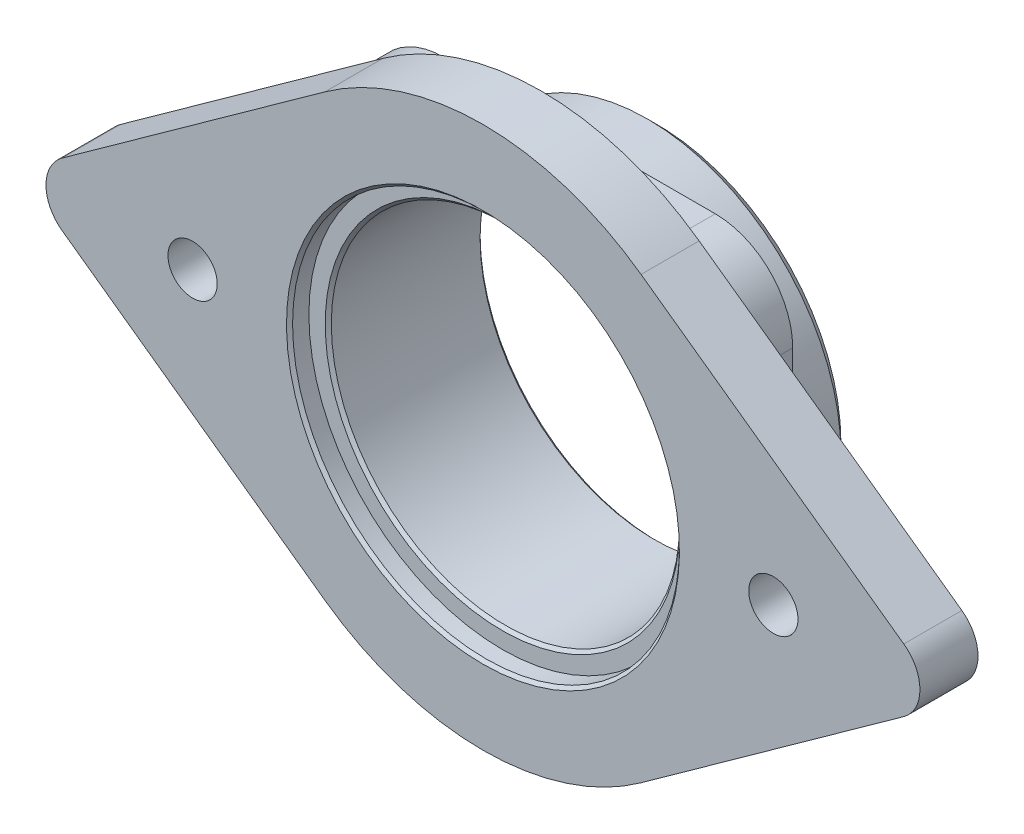
ISO-10303-21;
HEADER;
FILE_DESCRIPTION(('STEP AP214'),'2;1');
FILE_NAME('part.step','',(''),(''),'','','');
FILE_SCHEMA(('AUTOMOTIVE_DESIGN { 1 0 10303 214 1 1 1 1 }'));
ENDSEC;
DATA;
#1=APPLICATION_CONTEXT('core data for automotive mechanical design processes');
#2=APPLICATION_PROTOCOL_DEFINITION('international standard','automotive_design',2000,#1);
#3=PRODUCT_CONTEXT('',#1,'mechanical');
#4=PRODUCT('Part','Part','',(#3));
#5=PRODUCT_RELATED_PRODUCT_CATEGORY('part','',(#4));
#6=PRODUCT_DEFINITION_FORMATION('','',#4);
#7=PRODUCT_DEFINITION_CONTEXT('part definition',#1,'design');
#8=PRODUCT_DEFINITION('design','',#6,#7);
#9=PRODUCT_DEFINITION_SHAPE('','',#8);
#10=(LENGTH_UNIT() NAMED_UNIT(*) SI_UNIT(.MILLI.,.METRE.));
#11=(NAMED_UNIT(*) PLANE_ANGLE_UNIT() SI_UNIT($,.RADIAN.));
#12=(NAMED_UNIT(*) SI_UNIT($,.STERADIAN.) SOLID_ANGLE_UNIT());
#13=UNCERTAINTY_MEASURE_WITH_UNIT(LENGTH_MEASURE(1.E-05),#10,'distance_accuracy_value','');
#14=(GEOMETRIC_REPRESENTATION_CONTEXT(3) GLOBAL_UNCERTAINTY_ASSIGNED_CONTEXT((#13)) GLOBAL_UNIT_ASSIGNED_CONTEXT((#10,
#11,#12)) REPRESENTATION_CONTEXT('',''));
#15=CARTESIAN_POINT('',(0.,0.,0.));
#16=DIRECTION('',(0.,0.,1.));
#17=DIRECTION('',(1.,0.,0.));
#18=AXIS2_PLACEMENT_3D('',#15,#16,#17);
#19=CARTESIAN_POINT('',(0.,0.,-11.90625));
#20=DIRECTION('',(0.,0.,-1.));
#21=DIRECTION('',(-1.,0.,0.));
#22=AXIS2_PLACEMENT_3D('',#19,#20,#21);
#23=PLANE('',#22);
#24=CARTESIAN_POINT('',(0.,0.,-11.90625));
#25=DIRECTION('',(0.,0.,-1.));
#26=DIRECTION('',(-1.,0.,0.));
#27=AXIS2_PLACEMENT_3D('',#24,#25,#26);
#28=CIRCLE('',#27,14.5248);
#29=CARTESIAN_POINT('',(-14.5248,0.,-11.90625));
#30=VERTEX_POINT('',#29);
#31=EDGE_CURVE('E19',#30,#30,#28,.F.);
#32=ORIENTED_EDGE('',*,*,#31,.T.);
#33=EDGE_LOOP('',(#32));
#34=FACE_BOUND('',#33,.T.);
#35=CARTESIAN_POINT('',(0.,0.,-11.90625));
#36=DIRECTION('',(0.,0.,1.));
#37=DIRECTION('',(1.,0.,0.));
#38=AXIS2_PLACEMENT_3D('',#35,#36,#37);
#39=CIRCLE('',#38,15.06855);
#40=CARTESIAN_POINT('',(15.06855,0.,-11.90625));
#41=VERTEX_POINT('',#40);
#42=EDGE_CURVE('E167',#41,#41,#39,.T.);
#43=ORIENTED_EDGE('',*,*,#42,.F.);
#44=EDGE_LOOP('',(#43));
#45=FACE_BOUND('',#44,.T.);
#46=ADVANCED_FACE('F16',(#34,#45),#23,.T.);
#47=CARTESIAN_POINT('',(0.,0.,-11.90625));
#48=DIRECTION('',(0.,0.,-1.));
#49=DIRECTION('',(-1.,0.,0.));
#50=AXIS2_PLACEMENT_3D('',#47,#48,#49);
#51=CONICAL_SURFACE('',#50,14.5248,0.785398163397452);
#52=CARTESIAN_POINT('',(0.,0.,-11.65625));
#53=DIRECTION('',(0.,0.,-1.));
#54=DIRECTION('',(-1.,0.,0.));
#55=AXIS2_PLACEMENT_3D('',#52,#53,#54);
#56=CIRCLE('',#55,14.2748);
#57=CARTESIAN_POINT('',(-14.2748,0.,-11.65625));
#58=VERTEX_POINT('',#57);
#59=EDGE_CURVE('E165',#58,#58,#56,.F.);
#60=ORIENTED_EDGE('',*,*,#59,.T.);
#61=EDGE_LOOP('',(#60));
#62=FACE_BOUND('',#61,.T.);
#63=ORIENTED_EDGE('',*,*,#31,.F.);
#64=EDGE_LOOP('',(#63));
#65=FACE_BOUND('',#64,.T.);
#66=ADVANCED_FACE('F249',(#62,#65),#51,.F.);
#67=CARTESIAN_POINT('',(0.,0.,-11.1125));
#68=DIRECTION('',(0.,0.,1.));
#69=DIRECTION('',(1.,0.,0.));
#70=AXIS2_PLACEMENT_3D('',#67,#68,#69);
#71=CONICAL_SURFACE('',#70,15.8623,0.785398163397446);
#72=ORIENTED_EDGE('',*,*,#42,.T.);
#73=EDGE_LOOP('',(#72));
#74=FACE_BOUND('',#73,.T.);
#75=CARTESIAN_POINT('',(0.,0.,-11.1125));
#76=DIRECTION('',(0.,0.,1.));
#77=DIRECTION('',(1.,0.,0.));
#78=AXIS2_PLACEMENT_3D('',#75,#76,#77);
#79=CIRCLE('',#78,15.8623);
#80=CARTESIAN_POINT('',(15.8623,0.,-11.1125));
#81=VERTEX_POINT('',#80);
#82=EDGE_CURVE('E162',#81,#81,#79,.T.);
#83=ORIENTED_EDGE('',*,*,#82,.F.);
#84=EDGE_LOOP('',(#83));
#85=FACE_BOUND('',#84,.T.);
#86=ADVANCED_FACE('F251',(#74,#85),#71,.T.);
#87=CARTESIAN_POINT('',(0.,0.,2.38125));
#88=DIRECTION('',(0.,0.,-1.));
#89=DIRECTION('',(-1.,0.,0.));
#90=AXIS2_PLACEMENT_3D('',#87,#88,#89);
#91=CYLINDRICAL_SURFACE('',#90,14.2748);
#92=CARTESIAN_POINT('',(0.,0.,0.543749999999951));
#93=DIRECTION('',(0.,0.,1.));
#94=DIRECTION('',(1.,0.,0.));
#95=AXIS2_PLACEMENT_3D('',#92,#93,#94);
#96=CIRCLE('',#95,14.2748);
#97=CARTESIAN_POINT('',(14.2748,0.,0.54374999999995));
#98=VERTEX_POINT('',#97);
#99=EDGE_CURVE('E158',#98,#98,#96,.T.);
#100=ORIENTED_EDGE('',*,*,#99,.T.);
#101=EDGE_LOOP('',(#100));
#102=FACE_BOUND('',#101,.T.);
#103=ORIENTED_EDGE('',*,*,#59,.F.);
#104=EDGE_LOOP('',(#103));
#105=FACE_BOUND('',#104,.T.);
#106=ADVANCED_FACE('F258',(#102,#105),#91,.F.);
#107=CARTESIAN_POINT('',(0.,0.,-11.90625));
#108=DIRECTION('',(0.,0.,1.));
#109=DIRECTION('',(1.,0.,0.));
#110=AXIS2_PLACEMENT_3D('',#107,#108,#109);
#111=CYLINDRICAL_SURFACE('',#110,15.8623);
#112=ORIENTED_EDGE('',*,*,#82,.T.);
#113=EDGE_LOOP('',(#112));
#114=FACE_BOUND('',#113,.T.);
#115=CARTESIAN_POINT('',(0.,0.,-5.55625));
#116=DIRECTION('',(0.,0.,1.));
#117=DIRECTION('',(1.,0.,0.));
#118=AXIS2_PLACEMENT_3D('',#115,#116,#117);
#119=CIRCLE('',#118,15.8623);
#120=CARTESIAN_POINT('',(15.8623,0.,-5.55625));
#121=VERTEX_POINT('',#120);
#122=EDGE_CURVE('E161',#121,#121,#119,.F.);
#123=ORIENTED_EDGE('',*,*,#122,.T.);
#124=EDGE_LOOP('',(#123));
#125=FACE_BOUND('',#124,.T.);
#126=ADVANCED_FACE('F358',(#114,#125),#111,.T.);
#127=CARTESIAN_POINT('',(0.,0.,0.793750000000002));
#128=DIRECTION('',(0.,0.,1.));
#129=DIRECTION('',(1.,0.,0.));
#130=AXIS2_PLACEMENT_3D('',#127,#128,#129);
#131=CONICAL_SURFACE('',#130,14.5248,0.785398163397435);
#132=ORIENTED_EDGE('',*,*,#99,.F.);
#133=EDGE_LOOP('',(#132));
#134=FACE_BOUND('',#133,.T.);
#135=CARTESIAN_POINT('',(0.,0.,0.793750000000001));
#136=DIRECTION('',(0.,0.,1.));
#137=DIRECTION('',(1.,0.,0.));
#138=AXIS2_PLACEMENT_3D('',#135,#136,#137);
#139=CIRCLE('',#138,14.5248);
#140=CARTESIAN_POINT('',(14.5248,0.,0.793750000000001));
#141=VERTEX_POINT('',#140);
#142=EDGE_CURVE('E138',#141,#141,#139,.F.);
#143=ORIENTED_EDGE('',*,*,#142,.F.);
#144=EDGE_LOOP('',(#143));
#145=FACE_BOUND('',#144,.T.);
#146=ADVANCED_FACE('F354',(#134,#145),#131,.F.);
#147=CARTESIAN_POINT('',(0.,0.,-5.55625));
#148=DIRECTION('',(0.,0.,1.));
#149=DIRECTION('',(1.,0.,0.));
#150=AXIS2_PLACEMENT_3D('',#147,#148,#149);
#151=PLANE('',#150);
#152=ORIENTED_EDGE('',*,*,#122,.F.);
#153=EDGE_LOOP('',(#152));
#154=FACE_BOUND('',#153,.T.);
#155=CARTESIAN_POINT('',(11.1125,-11.1125,-5.55625));
#156=DIRECTION('',(0.,0.,1.));
#157=DIRECTION('',(1.,0.,0.));
#158=AXIS2_PLACEMENT_3D('',#155,#156,#157);
#159=CIRCLE('',#158,6.35);
#160=CARTESIAN_POINT('',(11.1125,-17.4625,-5.55625));
#161=VERTEX_POINT('',#160);
#162=CARTESIAN_POINT('',(17.4625,-11.1125,-5.55625));
#163=VERTEX_POINT('',#162);
#164=EDGE_CURVE('E151',#161,#163,#159,.T.);
#165=ORIENTED_EDGE('',*,*,#164,.F.);
#166=DIRECTION('',(1.,0.,0.));
#167=VECTOR('',#166,1.);
#168=CARTESIAN_POINT('',(17.4625,-17.4625,-5.55625));
#169=LINE('',#168,#167);
#170=CARTESIAN_POINT('',(-11.1125,-17.4625,-5.55625));
#171=VERTEX_POINT('',#170);
#172=EDGE_CURVE('E156',#161,#171,#169,.F.);
#173=ORIENTED_EDGE('',*,*,#172,.T.);
#174=CARTESIAN_POINT('',(-11.1125,-11.1125,-5.55625));
#175=DIRECTION('',(0.,0.,1.));
#176=DIRECTION('',(1.,0.,0.));
#177=AXIS2_PLACEMENT_3D('',#174,#175,#176);
#178=CIRCLE('',#177,6.35);
#179=CARTESIAN_POINT('',(-17.4625,-11.1125,-5.55625));
#180=VERTEX_POINT('',#179);
#181=EDGE_CURVE('E234',#180,#171,#178,.T.);
#182=ORIENTED_EDGE('',*,*,#181,.F.);
#183=DIRECTION('',(0.,1.,0.));
#184=VECTOR('',#183,1.);
#185=CARTESIAN_POINT('',(-17.4625,-17.4625,-5.55625));
#186=LINE('',#185,#184);
#187=CARTESIAN_POINT('',(-17.4625,11.1125,-5.55625));
#188=VERTEX_POINT('',#187);
#189=EDGE_CURVE('E233',#180,#188,#186,.T.);
#190=ORIENTED_EDGE('',*,*,#189,.T.);
#191=CARTESIAN_POINT('',(-11.1125,11.1125,-5.55625));
#192=DIRECTION('',(0.,0.,1.));
#193=DIRECTION('',(1.,0.,0.));
#194=AXIS2_PLACEMENT_3D('',#191,#192,#193);
#195=CIRCLE('',#194,6.35);
#196=CARTESIAN_POINT('',(-11.1125,17.4625,-5.55625));
#197=VERTEX_POINT('',#196);
#198=EDGE_CURVE('E229',#197,#188,#195,.T.);
#199=ORIENTED_EDGE('',*,*,#198,.F.);
#200=DIRECTION('',(1.,0.,0.));
#201=VECTOR('',#200,1.);
#202=CARTESIAN_POINT('',(17.4625,17.4625,-5.55625));
#203=LINE('',#202,#201);
#204=CARTESIAN_POINT('',(11.1125,17.4625,-5.55625));
#205=VERTEX_POINT('',#204);
#206=EDGE_CURVE('E134',#197,#205,#203,.T.);
#207=ORIENTED_EDGE('',*,*,#206,.T.);
#208=CARTESIAN_POINT('',(11.1125,11.1125,-5.55625));
#209=DIRECTION('',(0.,0.,1.));
#210=DIRECTION('',(1.,0.,0.));
#211=AXIS2_PLACEMENT_3D('',#208,#209,#210);
#212=CIRCLE('',#211,6.35);
#213=CARTESIAN_POINT('',(17.4625,11.1125,-5.55625));
#214=VERTEX_POINT('',#213);
#215=EDGE_CURVE('E127',#214,#205,#212,.T.);
#216=ORIENTED_EDGE('',*,*,#215,.F.);
#217=DIRECTION('',(0.,1.,0.));
#218=VECTOR('',#217,1.);
#219=CARTESIAN_POINT('',(17.4625,-17.4625,-5.55625));
#220=LINE('',#219,#218);
#221=EDGE_CURVE('E131',#214,#163,#220,.F.);
#222=ORIENTED_EDGE('',*,*,#221,.T.);
#223=EDGE_LOOP('',(#165,#173,#182,#190,#199,#207,#216,#222));
#224=FACE_BOUND('',#223,.T.);
#225=ADVANCED_FACE('F129',(#154,#224),#151,.F.);
#226=CARTESIAN_POINT('',(0.,0.,0.79375));
#227=DIRECTION('',(0.,0.,1.));
#228=DIRECTION('',(1.,0.,0.));
#229=AXIS2_PLACEMENT_3D('',#226,#227,#228);
#230=PLANE('',#229);
#231=CARTESIAN_POINT('',(0.,0.,0.79375));
#232=DIRECTION('',(0.,0.,1.));
#233=DIRECTION('',(1.,0.,0.));
#234=AXIS2_PLACEMENT_3D('',#231,#232,#233);
#235=CIRCLE('',#234,15.8623);
#236=CARTESIAN_POINT('',(15.8623,0.,0.79375));
#237=VERTEX_POINT('',#236);
#238=EDGE_CURVE('E226',#237,#237,#235,.T.);
#239=ORIENTED_EDGE('',*,*,#238,.T.);
#240=EDGE_LOOP('',(#239));
#241=FACE_BOUND('',#240,.T.);
#242=ORIENTED_EDGE('',*,*,#142,.T.);
#243=EDGE_LOOP('',(#242));
#244=FACE_BOUND('',#243,.T.);
#245=ADVANCED_FACE('F348',(#241,#244),#230,.T.);
#246=CARTESIAN_POINT('',(11.1125,11.1125,-5.55625));
#247=DIRECTION('',(0.,0.,1.));
#248=DIRECTION('',(1.,0.,0.));
#249=AXIS2_PLACEMENT_3D('',#246,#247,#248);
#250=CYLINDRICAL_SURFACE('',#249,6.35);
#251=CARTESIAN_POINT('',(11.1125,11.1125,-2.38125));
#252=DIRECTION('',(0.,0.,1.));
#253=DIRECTION('',(1.,0.,0.));
#254=AXIS2_PLACEMENT_3D('',#251,#252,#253);
#255=CIRCLE('',#254,6.35);
#256=CARTESIAN_POINT('',(11.1125,17.4625,-2.38125));
#257=VERTEX_POINT('',#256);
#258=CARTESIAN_POINT('',(17.4625,11.1125,-2.38125));
#259=VERTEX_POINT('',#258);
#260=EDGE_CURVE('E143',#257,#259,#255,.F.);
#261=ORIENTED_EDGE('',*,*,#260,.T.);
#262=DIRECTION('',(0.,0.,1.));
#263=VECTOR('',#262,1.);
#264=CARTESIAN_POINT('',(17.4625,11.1125,-5.55625));
#265=LINE('',#264,#263);
#266=EDGE_CURVE('E137',#259,#214,#265,.F.);
#267=ORIENTED_EDGE('',*,*,#266,.T.);
#268=ORIENTED_EDGE('',*,*,#215,.T.);
#269=DIRECTION('',(0.,0.,-1.));
#270=VECTOR('',#269,1.);
#271=CARTESIAN_POINT('',(11.1125,17.4625,-5.55625));
#272=LINE('',#271,#270);
#273=EDGE_CURVE('E602',#205,#257,#272,.F.);
#274=ORIENTED_EDGE('',*,*,#273,.T.);
#275=EDGE_LOOP('',(#261,#267,#268,#274));
#276=FACE_BOUND('',#275,.T.);
#277=ADVANCED_FACE('F141',(#276),#250,.T.);
#278=CARTESIAN_POINT('',(17.4625,-17.4625,-5.55625));
#279=DIRECTION('',(-1.,0.,0.));
#280=DIRECTION('',(0.,0.,1.));
#281=AXIS2_PLACEMENT_3D('',#278,#279,#280);
#282=PLANE('',#281);
#283=DIRECTION('',(0.,0.,1.));
#284=VECTOR('',#283,1.);
#285=CARTESIAN_POINT('',(17.4625,-11.1125,-5.55625));
#286=LINE('',#285,#284);
#287=CARTESIAN_POINT('',(17.4625,-11.1125,-2.38125));
#288=VERTEX_POINT('',#287);
#289=EDGE_CURVE('E149',#163,#288,#286,.T.);
#290=ORIENTED_EDGE('',*,*,#289,.F.);
#291=ORIENTED_EDGE('',*,*,#221,.F.);
#292=ORIENTED_EDGE('',*,*,#266,.F.);
#293=DIRECTION('',(0.,1.,0.));
#294=VECTOR('',#293,1.);
#295=CARTESIAN_POINT('',(17.4625,0.,-2.38125));
#296=LINE('',#295,#294);
#297=EDGE_CURVE('E224',#259,#288,#296,.F.);
#298=ORIENTED_EDGE('',*,*,#297,.T.);
#299=EDGE_LOOP('',(#290,#291,#292,#298));
#300=FACE_BOUND('',#299,.T.);
#301=ADVANCED_FACE('F147',(#300),#282,.F.);
#302=CARTESIAN_POINT('',(11.1125,-11.1125,-5.55625));
#303=DIRECTION('',(0.,0.,1.));
#304=DIRECTION('',(1.,0.,0.));
#305=AXIS2_PLACEMENT_3D('',#302,#303,#304);
#306=CYLINDRICAL_SURFACE('',#305,6.35);
#307=CARTESIAN_POINT('',(11.1125,-11.1125,-2.38125));
#308=DIRECTION('',(0.,0.,1.));
#309=DIRECTION('',(1.,0.,0.));
#310=AXIS2_PLACEMENT_3D('',#307,#308,#309);
#311=CIRCLE('',#310,6.35);
#312=CARTESIAN_POINT('',(11.1125,-17.4625,-2.38125));
#313=VERTEX_POINT('',#312);
#314=EDGE_CURVE('E222',#288,#313,#311,.F.);
#315=ORIENTED_EDGE('',*,*,#314,.T.);
#316=DIRECTION('',(0.,0.,1.));
#317=VECTOR('',#316,1.);
#318=CARTESIAN_POINT('',(11.1125,-17.4625,-5.55625));
#319=LINE('',#318,#317);
#320=EDGE_CURVE('E611',#313,#161,#319,.F.);
#321=ORIENTED_EDGE('',*,*,#320,.T.);
#322=ORIENTED_EDGE('',*,*,#164,.T.);
#323=ORIENTED_EDGE('',*,*,#289,.T.);
#324=EDGE_LOOP('',(#315,#321,#322,#323));
#325=FACE_BOUND('',#324,.T.);
#326=ADVANCED_FACE('F339',(#325),#306,.T.);
#327=CARTESIAN_POINT('',(17.4625,-17.4625,-5.55625));
#328=DIRECTION('',(0.,1.,0.));
#329=DIRECTION('',(0.,0.,1.));
#330=AXIS2_PLACEMENT_3D('',#327,#328,#329);
#331=PLANE('',#330);
#332=ORIENTED_EDGE('',*,*,#320,.F.);
#333=DIRECTION('',(1.,0.,0.));
#334=VECTOR('',#333,1.);
#335=CARTESIAN_POINT('',(0.,-17.4625,-2.38125));
#336=LINE('',#335,#334);
#337=CARTESIAN_POINT('',(-11.1125,-17.4625,-2.38125));
#338=VERTEX_POINT('',#337);
#339=EDGE_CURVE('E221',#313,#338,#336,.F.);
#340=ORIENTED_EDGE('',*,*,#339,.T.);
#341=DIRECTION('',(0.,0.,1.));
#342=VECTOR('',#341,1.);
#343=CARTESIAN_POINT('',(-11.1125,-17.4625,-5.55625));
#344=LINE('',#343,#342);
#345=EDGE_CURVE('E236',#171,#338,#344,.T.);
#346=ORIENTED_EDGE('',*,*,#345,.F.);
#347=ORIENTED_EDGE('',*,*,#172,.F.);
#348=EDGE_LOOP('',(#332,#340,#346,#347));
#349=FACE_BOUND('',#348,.T.);
#350=ADVANCED_FACE('F335',(#349),#331,.F.);
#351=CARTESIAN_POINT('',(-11.1125,-11.1125,-5.55625));
#352=DIRECTION('',(0.,0.,1.));
#353=DIRECTION('',(1.,0.,0.));
#354=AXIS2_PLACEMENT_3D('',#351,#352,#353);
#355=CYLINDRICAL_SURFACE('',#354,6.35);
#356=CARTESIAN_POINT('',(-11.1125,-11.1125,-2.38125));
#357=DIRECTION('',(0.,0.,1.));
#358=DIRECTION('',(1.,0.,0.));
#359=AXIS2_PLACEMENT_3D('',#356,#357,#358);
#360=CIRCLE('',#359,6.35);
#361=CARTESIAN_POINT('',(-17.4625,-11.1125,-2.38125));
#362=VERTEX_POINT('',#361);
#363=EDGE_CURVE('E219',#338,#362,#360,.F.);
#364=ORIENTED_EDGE('',*,*,#363,.T.);
#365=DIRECTION('',(0.,0.,-1.));
#366=VECTOR('',#365,1.);
#367=CARTESIAN_POINT('',(-17.4625,-11.1125,-5.55625));
#368=LINE('',#367,#366);
#369=EDGE_CURVE('E606',#362,#180,#368,.T.);
#370=ORIENTED_EDGE('',*,*,#369,.T.);
#371=ORIENTED_EDGE('',*,*,#181,.T.);
#372=ORIENTED_EDGE('',*,*,#345,.T.);
#373=EDGE_LOOP('',(#364,#370,#371,#372));
#374=FACE_BOUND('',#373,.T.);
#375=ADVANCED_FACE('F331',(#374),#355,.T.);
#376=CARTESIAN_POINT('',(-17.4625,-17.4625,-5.55625));
#377=DIRECTION('',(1.,0.,0.));
#378=DIRECTION('',(0.,0.,-1.));
#379=AXIS2_PLACEMENT_3D('',#376,#377,#378);
#380=PLANE('',#379);
#381=ORIENTED_EDGE('',*,*,#369,.F.);
#382=DIRECTION('',(0.,1.,0.));
#383=VECTOR('',#382,1.);
#384=CARTESIAN_POINT('',(-17.4625,0.,-2.38125));
#385=LINE('',#384,#383);
#386=CARTESIAN_POINT('',(-17.4625,11.1125,-2.38125));
#387=VERTEX_POINT('',#386);
#388=EDGE_CURVE('E218',#362,#387,#385,.T.);
#389=ORIENTED_EDGE('',*,*,#388,.T.);
#390=DIRECTION('',(0.,0.,1.));
#391=VECTOR('',#390,1.);
#392=CARTESIAN_POINT('',(-17.4625,11.1125,-5.55625));
#393=LINE('',#392,#391);
#394=EDGE_CURVE('E232',#188,#387,#393,.T.);
#395=ORIENTED_EDGE('',*,*,#394,.F.);
#396=ORIENTED_EDGE('',*,*,#189,.F.);
#397=EDGE_LOOP('',(#381,#389,#395,#396));
#398=FACE_BOUND('',#397,.T.);
#399=ADVANCED_FACE('F327',(#398),#380,.F.);
#400=CARTESIAN_POINT('',(-11.1125,11.1125,-5.55625));
#401=DIRECTION('',(0.,0.,1.));
#402=DIRECTION('',(1.,0.,0.));
#403=AXIS2_PLACEMENT_3D('',#400,#401,#402);
#404=CYLINDRICAL_SURFACE('',#403,6.35);
#405=CARTESIAN_POINT('',(-11.1125,11.1125,-2.38125));
#406=DIRECTION('',(0.,0.,1.));
#407=DIRECTION('',(1.,0.,0.));
#408=AXIS2_PLACEMENT_3D('',#405,#406,#407);
#409=CIRCLE('',#408,6.35);
#410=CARTESIAN_POINT('',(-11.1125,17.4625,-2.38125));
#411=VERTEX_POINT('',#410);
#412=EDGE_CURVE('E215',#387,#411,#409,.F.);
#413=ORIENTED_EDGE('',*,*,#412,.T.);
#414=DIRECTION('',(0.,0.,-1.));
#415=VECTOR('',#414,1.);
#416=CARTESIAN_POINT('',(-11.1125,17.4625,-5.55625));
#417=LINE('',#416,#415);
#418=EDGE_CURVE('E599',#411,#197,#417,.T.);
#419=ORIENTED_EDGE('',*,*,#418,.T.);
#420=ORIENTED_EDGE('',*,*,#198,.T.);
#421=ORIENTED_EDGE('',*,*,#394,.T.);
#422=EDGE_LOOP('',(#413,#419,#420,#421));
#423=FACE_BOUND('',#422,.T.);
#424=ADVANCED_FACE('F323',(#423),#404,.T.);
#425=CARTESIAN_POINT('',(17.4625,17.4625,-5.55625));
#426=DIRECTION('',(0.,-1.,0.));
#427=DIRECTION('',(0.,0.,-1.));
#428=AXIS2_PLACEMENT_3D('',#425,#426,#427);
#429=PLANE('',#428);
#430=ORIENTED_EDGE('',*,*,#418,.F.);
#431=DIRECTION('',(1.,0.,0.));
#432=VECTOR('',#431,1.);
#433=CARTESIAN_POINT('',(0.,17.4625,-2.38125));
#434=LINE('',#433,#432);
#435=EDGE_CURVE('E217',#411,#257,#434,.T.);
#436=ORIENTED_EDGE('',*,*,#435,.T.);
#437=ORIENTED_EDGE('',*,*,#273,.F.);
#438=ORIENTED_EDGE('',*,*,#206,.F.);
#439=EDGE_LOOP('',(#430,#436,#437,#438));
#440=FACE_BOUND('',#439,.T.);
#441=ADVANCED_FACE('F319',(#440),#429,.F.);
#442=CARTESIAN_POINT('',(0.,0.,0.79375));
#443=DIRECTION('',(0.,0.,1.));
#444=DIRECTION('',(1.,0.,0.));
#445=AXIS2_PLACEMENT_3D('',#442,#443,#444);
#446=CYLINDRICAL_SURFACE('',#445,15.8623);
#447=ORIENTED_EDGE('',*,*,#238,.F.);
#448=EDGE_LOOP('',(#447));
#449=FACE_BOUND('',#448,.T.);
#450=CARTESIAN_POINT('',(0.,0.,2.13125));
#451=DIRECTION('',(0.,0.,1.));
#452=DIRECTION('',(1.,0.,0.));
#453=AXIS2_PLACEMENT_3D('',#450,#451,#452);
#454=CIRCLE('',#453,15.8623);
#455=CARTESIAN_POINT('',(15.8623,0.,2.13125));
#456=VERTEX_POINT('',#455);
#457=EDGE_CURVE('E214',#456,#456,#454,.T.);
#458=ORIENTED_EDGE('',*,*,#457,.T.);
#459=EDGE_LOOP('',(#458));
#460=FACE_BOUND('',#459,.T.);
#461=ADVANCED_FACE('F315',(#449,#460),#446,.F.);
#462=CARTESIAN_POINT('',(0.,0.,-2.38125));
#463=DIRECTION('',(0.,0.,1.));
#464=DIRECTION('',(1.,0.,0.));
#465=AXIS2_PLACEMENT_3D('',#462,#463,#464);
#466=PLANE('',#465);
#467=CARTESIAN_POINT('',(23.8125,0.,-2.38125));
#468=DIRECTION('',(0.,0.,1.));
#469=DIRECTION('',(1.,0.,0.));
#470=AXIS2_PLACEMENT_3D('',#467,#468,#469);
#471=CIRCLE('',#470,2.01929999999999);
#472=CARTESIAN_POINT('',(25.8318,0.,-2.38125));
#473=VERTEX_POINT('',#472);
#474=EDGE_CURVE('E207',#473,#473,#471,.T.);
#475=ORIENTED_EDGE('',*,*,#474,.T.);
#476=EDGE_LOOP('',(#475));
#477=FACE_BOUND('',#476,.T.);
#478=CARTESIAN_POINT('',(-23.8125,0.,-2.38125));
#479=DIRECTION('',(0.,0.,1.));
#480=DIRECTION('',(1.,0.,0.));
#481=AXIS2_PLACEMENT_3D('',#478,#479,#480);
#482=CIRCLE('',#481,2.01929999999999);
#483=CARTESIAN_POINT('',(-21.7932,0.,-2.38125));
#484=VERTEX_POINT('',#483);
#485=EDGE_CURVE('E211',#484,#484,#482,.T.);
#486=ORIENTED_EDGE('',*,*,#485,.T.);
#487=EDGE_LOOP('',(#486));
#488=FACE_BOUND('',#487,.T.);
#489=ORIENTED_EDGE('',*,*,#412,.F.);
#490=ORIENTED_EDGE('',*,*,#388,.F.);
#491=ORIENTED_EDGE('',*,*,#363,.F.);
#492=ORIENTED_EDGE('',*,*,#339,.F.);
#493=ORIENTED_EDGE('',*,*,#314,.F.);
#494=ORIENTED_EDGE('',*,*,#297,.F.);
#495=ORIENTED_EDGE('',*,*,#260,.F.);
#496=ORIENTED_EDGE('',*,*,#435,.F.);
#497=EDGE_LOOP('',(#489,#490,#491,#492,#493,#494,#495,#496));
#498=FACE_BOUND('',#497,.T.);
#499=CARTESIAN_POINT('',(32.6571428571429,0.,-2.38125));
#500=DIRECTION('',(0.,0.,-1.));
#501=DIRECTION('',(-1.,0.,0.));
#502=AXIS2_PLACEMENT_3D('',#499,#500,#501);
#503=CIRCLE('',#502,3.175);
#504=CARTESIAN_POINT('',(34.5092261904762,-2.57883933706403,-2.38125));
#505=VERTEX_POINT('',#504);
#506=CARTESIAN_POINT('',(34.5092261904762,2.57883933706405,-2.38125));
#507=VERTEX_POINT('',#506);
#508=EDGE_CURVE('E203',#505,#507,#503,.F.);
#509=ORIENTED_EDGE('',*,*,#508,.F.);
#510=DIRECTION('',(0.812232862067414,0.583333333333333,0.));
#511=VECTOR('',#510,1.);
#512=CARTESIAN_POINT('',(12.9645833333333,-18.0518753594483,-2.38125));
#513=LINE('',#512,#511);
#514=CARTESIAN_POINT('',(12.9645833333333,-18.0518753594483,-2.38125));
#515=VERTEX_POINT('',#514);
#516=EDGE_CURVE('E210',#515,#505,#513,.T.);
#517=ORIENTED_EDGE('',*,*,#516,.F.);
#518=CARTESIAN_POINT('',(0.,0.,-2.38125));
#519=DIRECTION('',(0.,0.,-1.));
#520=DIRECTION('',(-1.,0.,0.));
#521=AXIS2_PLACEMENT_3D('',#518,#519,#520);
#522=CIRCLE('',#521,22.225);
#523=CARTESIAN_POINT('',(-12.9645833333333,-18.0518753594483,-2.38125));
#524=VERTEX_POINT('',#523);
#525=EDGE_CURVE('E189',#524,#515,#522,.F.);
#526=ORIENTED_EDGE('',*,*,#525,.F.);
#527=DIRECTION('',(-0.812232862067414,0.583333333333333,0.));
#528=VECTOR('',#527,1.);
#529=CARTESIAN_POINT('',(-12.9645833333333,-18.0518753594483,-2.38125));
#530=LINE('',#529,#528);
#531=CARTESIAN_POINT('',(-34.5092261904762,-2.57883933706404,-2.38125));
#532=VERTEX_POINT('',#531);
#533=EDGE_CURVE('E197',#524,#532,#530,.T.);
#534=ORIENTED_EDGE('',*,*,#533,.T.);
#535=CARTESIAN_POINT('',(-32.6571428571429,0.,-2.38125));
#536=DIRECTION('',(0.,0.,-1.));
#537=DIRECTION('',(-1.,0.,0.));
#538=AXIS2_PLACEMENT_3D('',#535,#536,#537);
#539=CIRCLE('',#538,3.175);
#540=CARTESIAN_POINT('',(-34.5092261904762,2.57883933706403,-2.38125));
#541=VERTEX_POINT('',#540);
#542=EDGE_CURVE('E194',#541,#532,#539,.F.);
#543=ORIENTED_EDGE('',*,*,#542,.F.);
#544=DIRECTION('',(0.812232862067414,0.583333333333333,0.));
#545=VECTOR('',#544,1.);
#546=CARTESIAN_POINT('',(-12.9645833333333,18.0518753594483,-2.38125));
#547=LINE('',#546,#545);
#548=CARTESIAN_POINT('',(-12.9645833333333,18.0518753594483,-2.38125));
#549=VERTEX_POINT('',#548);
#550=EDGE_CURVE('E629',#541,#549,#547,.T.);
#551=ORIENTED_EDGE('',*,*,#550,.T.);
#552=CARTESIAN_POINT('',(0.,0.,-2.38125));
#553=DIRECTION('',(0.,0.,-1.));
#554=DIRECTION('',(-1.,0.,0.));
#555=AXIS2_PLACEMENT_3D('',#552,#553,#554);
#556=CIRCLE('',#555,22.225);
#557=CARTESIAN_POINT('',(12.9645833333333,18.0518753594483,-2.38125));
#558=VERTEX_POINT('',#557);
#559=EDGE_CURVE('E199',#558,#549,#556,.F.);
#560=ORIENTED_EDGE('',*,*,#559,.F.);
#561=DIRECTION('',(-0.812232862067414,0.583333333333333,0.));
#562=VECTOR('',#561,1.);
#563=CARTESIAN_POINT('',(12.9645833333333,18.0518753594483,-2.38125));
#564=LINE('',#563,#562);
#565=EDGE_CURVE('E202',#507,#558,#564,.T.);
#566=ORIENTED_EDGE('',*,*,#565,.F.);
#567=EDGE_LOOP('',(#509,#517,#526,#534,#543,#551,#560,#566));
#568=FACE_BOUND('',#567,.T.);
#569=ADVANCED_FACE('F311',(#477,#488,#498,#568),#466,.F.);
#570=CARTESIAN_POINT('',(0.,0.,2.38125));
#571=DIRECTION('',(0.,0.,1.));
#572=DIRECTION('',(0.,-1.,0.));
#573=AXIS2_PLACEMENT_3D('',#570,#571,#572);
#574=CONICAL_SURFACE('',#573,16.1123,0.78539816339742);
#575=ORIENTED_EDGE('',*,*,#457,.F.);
#576=EDGE_LOOP('',(#575));
#577=FACE_BOUND('',#576,.T.);
#578=CARTESIAN_POINT('',(0.,0.,2.38125));
#579=DIRECTION('',(0.,0.,1.));
#580=DIRECTION('',(0.,-1.,0.));
#581=AXIS2_PLACEMENT_3D('',#578,#579,#580);
#582=CIRCLE('',#581,16.1123);
#583=CARTESIAN_POINT('',(0.,-16.1123,2.38125));
#584=VERTEX_POINT('',#583);
#585=EDGE_CURVE('E186',#584,#584,#582,.F.);
#586=ORIENTED_EDGE('',*,*,#585,.F.);
#587=EDGE_LOOP('',(#586));
#588=FACE_BOUND('',#587,.T.);
#589=ADVANCED_FACE('F307',(#577,#588),#574,.F.);
#590=CARTESIAN_POINT('',(-23.8125,0.,2.38125));
#591=DIRECTION('',(0.,0.,1.));
#592=DIRECTION('',(1.,0.,0.));
#593=AXIS2_PLACEMENT_3D('',#590,#591,#592);
#594=CYLINDRICAL_SURFACE('',#593,2.01929999999999);
#595=CARTESIAN_POINT('',(-23.8125,0.,2.38125));
#596=DIRECTION('',(0.,0.,1.));
#597=DIRECTION('',(1.,0.,0.));
#598=AXIS2_PLACEMENT_3D('',#595,#596,#597);
#599=CIRCLE('',#598,2.01929999999999);
#600=CARTESIAN_POINT('',(-21.7932,0.,2.38125));
#601=VERTEX_POINT('',#600);
#602=EDGE_CURVE('E183',#601,#601,#599,.F.);
#603=ORIENTED_EDGE('',*,*,#602,.F.);
#604=EDGE_LOOP('',(#603));
#605=FACE_BOUND('',#604,.T.);
#606=ORIENTED_EDGE('',*,*,#485,.F.);
#607=EDGE_LOOP('',(#606));
#608=FACE_BOUND('',#607,.T.);
#609=ADVANCED_FACE('F303',(#605,#608),#594,.F.);
#610=CARTESIAN_POINT('',(23.8125,0.,2.38125));
#611=DIRECTION('',(0.,0.,1.));
#612=DIRECTION('',(1.,0.,0.));
#613=AXIS2_PLACEMENT_3D('',#610,#611,#612);
#614=CYLINDRICAL_SURFACE('',#613,2.01929999999999);
#615=CARTESIAN_POINT('',(23.8125,0.,2.38125));
#616=DIRECTION('',(0.,0.,1.));
#617=DIRECTION('',(1.,0.,0.));
#618=AXIS2_PLACEMENT_3D('',#615,#616,#617);
#619=CIRCLE('',#618,2.01929999999999);
#620=CARTESIAN_POINT('',(25.8318,0.,2.38125));
#621=VERTEX_POINT('',#620);
#622=EDGE_CURVE('E180',#621,#621,#619,.F.);
#623=ORIENTED_EDGE('',*,*,#622,.F.);
#624=EDGE_LOOP('',(#623));
#625=FACE_BOUND('',#624,.T.);
#626=ORIENTED_EDGE('',*,*,#474,.F.);
#627=EDGE_LOOP('',(#626));
#628=FACE_BOUND('',#627,.T.);
#629=ADVANCED_FACE('F299',(#625,#628),#614,.F.);
#630=CARTESIAN_POINT('',(12.9645833333333,-18.0518753594483,2.38125));
#631=DIRECTION('',(0.583333333333333,-0.812232862067414,0.));
#632=DIRECTION('',(0.812232862067414,0.583333333333333,0.));
#633=AXIS2_PLACEMENT_3D('',#630,#631,#632);
#634=PLANE('',#633);
#635=DIRECTION('',(0.812232862067414,0.583333333333333,0.));
#636=VECTOR('',#635,1.);
#637=CARTESIAN_POINT('',(12.9645833333333,-18.0518753594483,2.38125));
#638=LINE('',#637,#636);
#639=CARTESIAN_POINT('',(12.9645833333333,-18.0518753594483,2.38125));
#640=VERTEX_POINT('',#639);
#641=CARTESIAN_POINT('',(34.5092261904762,-2.57883933706403,2.38125));
#642=VERTEX_POINT('',#641);
#643=EDGE_CURVE('E179',#640,#642,#638,.T.);
#644=ORIENTED_EDGE('',*,*,#643,.F.);
#645=DIRECTION('',(0.,0.,-1.));
#646=VECTOR('',#645,1.);
#647=CARTESIAN_POINT('',(12.9645833333333,-18.0518753594483,2.38125));
#648=LINE('',#647,#646);
#649=EDGE_CURVE('E192',#515,#640,#648,.F.);
#650=ORIENTED_EDGE('',*,*,#649,.F.);
#651=ORIENTED_EDGE('',*,*,#516,.T.);
#652=DIRECTION('',(0.,0.,-1.));
#653=VECTOR('',#652,1.);
#654=CARTESIAN_POINT('',(34.5092261904762,-2.57883933706403,2.38125));
#655=LINE('',#654,#653);
#656=EDGE_CURVE('E206',#642,#505,#655,.T.);
#657=ORIENTED_EDGE('',*,*,#656,.F.);
#658=EDGE_LOOP('',(#644,#650,#651,#657));
#659=FACE_BOUND('',#658,.T.);
#660=ADVANCED_FACE('F295',(#659),#634,.T.);
#661=CARTESIAN_POINT('',(32.6571428571429,0.,2.38125));
#662=DIRECTION('',(0.,0.,-1.));
#663=DIRECTION('',(-1.,0.,0.));
#664=AXIS2_PLACEMENT_3D('',#661,#662,#663);
#665=CYLINDRICAL_SURFACE('',#664,3.175);
#666=ORIENTED_EDGE('',*,*,#508,.T.);
#667=DIRECTION('',(0.,0.,1.));
#668=VECTOR('',#667,1.);
#669=CARTESIAN_POINT('',(34.5092261904762,2.57883933706405,2.38125));
#670=LINE('',#669,#668);
#671=CARTESIAN_POINT('',(34.5092261904762,2.57883933706405,2.38125));
#672=VERTEX_POINT('',#671);
#673=EDGE_CURVE('E205',#672,#507,#670,.F.);
#674=ORIENTED_EDGE('',*,*,#673,.F.);
#675=CARTESIAN_POINT('',(32.6571428571429,0.,2.38125));
#676=DIRECTION('',(0.,0.,-1.));
#677=DIRECTION('',(-1.,0.,0.));
#678=AXIS2_PLACEMENT_3D('',#675,#676,#677);
#679=CIRCLE('',#678,3.175);
#680=EDGE_CURVE('E176',#642,#672,#679,.F.);
#681=ORIENTED_EDGE('',*,*,#680,.F.);
#682=ORIENTED_EDGE('',*,*,#656,.T.);
#683=EDGE_LOOP('',(#666,#674,#681,#682));
#684=FACE_BOUND('',#683,.T.);
#685=ADVANCED_FACE('F291',(#684),#665,.T.);
#686=CARTESIAN_POINT('',(12.9645833333333,18.0518753594483,2.38125));
#687=DIRECTION('',(0.583333333333333,0.812232862067414,0.));
#688=DIRECTION('',(-0.812232862067414,0.583333333333333,0.));
#689=AXIS2_PLACEMENT_3D('',#686,#687,#688);
#690=PLANE('',#689);
#691=ORIENTED_EDGE('',*,*,#565,.T.);
#692=DIRECTION('',(0.,0.,-1.));
#693=VECTOR('',#692,1.);
#694=CARTESIAN_POINT('',(12.9645833333333,18.0518753594483,2.38125));
#695=LINE('',#694,#693);
#696=CARTESIAN_POINT('',(12.9645833333333,18.0518753594483,2.38125));
#697=VERTEX_POINT('',#696);
#698=EDGE_CURVE('E201',#697,#558,#695,.T.);
#699=ORIENTED_EDGE('',*,*,#698,.F.);
#700=DIRECTION('',(-0.812232862067414,0.583333333333333,0.));
#701=VECTOR('',#700,1.);
#702=CARTESIAN_POINT('',(34.5092261904762,2.57883933706405,2.38125));
#703=LINE('',#702,#701);
#704=EDGE_CURVE('E175',#672,#697,#703,.T.);
#705=ORIENTED_EDGE('',*,*,#704,.F.);
#706=ORIENTED_EDGE('',*,*,#673,.T.);
#707=EDGE_LOOP('',(#691,#699,#705,#706));
#708=FACE_BOUND('',#707,.T.);
#709=ADVANCED_FACE('F287',(#708),#690,.T.);
#710=CARTESIAN_POINT('',(0.,0.,2.38125));
#711=DIRECTION('',(0.,0.,-1.));
#712=DIRECTION('',(-1.,0.,0.));
#713=AXIS2_PLACEMENT_3D('',#710,#711,#712);
#714=CYLINDRICAL_SURFACE('',#713,22.225);
#715=CARTESIAN_POINT('',(0.,0.,2.38125));
#716=DIRECTION('',(0.,0.,-1.));
#717=DIRECTION('',(-1.,0.,0.));
#718=AXIS2_PLACEMENT_3D('',#715,#716,#717);
#719=CIRCLE('',#718,22.225);
#720=CARTESIAN_POINT('',(-12.9645833333333,18.0518753594483,2.38125));
#721=VERTEX_POINT('',#720);
#722=EDGE_CURVE('E172',#697,#721,#719,.F.);
#723=ORIENTED_EDGE('',*,*,#722,.F.);
#724=ORIENTED_EDGE('',*,*,#698,.T.);
#725=ORIENTED_EDGE('',*,*,#559,.T.);
#726=DIRECTION('',(0.,0.,1.));
#727=VECTOR('',#726,1.);
#728=CARTESIAN_POINT('',(-12.9645833333333,18.0518753594483,2.38125));
#729=LINE('',#728,#727);
#730=EDGE_CURVE('E631',#549,#721,#729,.T.);
#731=ORIENTED_EDGE('',*,*,#730,.T.);
#732=EDGE_LOOP('',(#723,#724,#725,#731));
#733=FACE_BOUND('',#732,.T.);
#734=ADVANCED_FACE('F283',(#733),#714,.T.);
#735=CARTESIAN_POINT('',(-12.9645833333333,18.0518753594483,2.38125));
#736=DIRECTION('',(0.583333333333333,-0.812232862067414,0.));
#737=DIRECTION('',(0.812232862067414,0.583333333333333,0.));
#738=AXIS2_PLACEMENT_3D('',#735,#736,#737);
#739=PLANE('',#738);
#740=DIRECTION('',(0.,0.,-1.));
#741=VECTOR('',#740,1.);
#742=CARTESIAN_POINT('',(-34.5092261904762,2.57883933706403,2.38125));
#743=LINE('',#742,#741);
#744=CARTESIAN_POINT('',(-34.5092261904762,2.57883933706403,2.38125));
#745=VERTEX_POINT('',#744);
#746=EDGE_CURVE('E198',#745,#541,#743,.T.);
#747=ORIENTED_EDGE('',*,*,#746,.F.);
#748=DIRECTION('',(-0.812232862067414,-0.583333333333333,0.));
#749=VECTOR('',#748,1.);
#750=CARTESIAN_POINT('',(-12.9645833333333,18.0518753594483,2.38125));
#751=LINE('',#750,#749);
#752=EDGE_CURVE('E171',#721,#745,#751,.T.);
#753=ORIENTED_EDGE('',*,*,#752,.F.);
#754=ORIENTED_EDGE('',*,*,#730,.F.);
#755=ORIENTED_EDGE('',*,*,#550,.F.);
#756=EDGE_LOOP('',(#747,#753,#754,#755));
#757=FACE_BOUND('',#756,.T.);
#758=ADVANCED_FACE('F279',(#757),#739,.F.);
#759=CARTESIAN_POINT('',(-32.6571428571429,0.,2.38125));
#760=DIRECTION('',(0.,0.,-1.));
#761=DIRECTION('',(-1.,0.,0.));
#762=AXIS2_PLACEMENT_3D('',#759,#760,#761);
#763=CYLINDRICAL_SURFACE('',#762,3.175);
#764=ORIENTED_EDGE('',*,*,#542,.T.);
#765=DIRECTION('',(0.,0.,1.));
#766=VECTOR('',#765,1.);
#767=CARTESIAN_POINT('',(-34.5092261904762,-2.57883933706404,2.38125));
#768=LINE('',#767,#766);
#769=CARTESIAN_POINT('',(-34.5092261904762,-2.57883933706404,2.38125));
#770=VERTEX_POINT('',#769);
#771=EDGE_CURVE('E193',#532,#770,#768,.T.);
#772=ORIENTED_EDGE('',*,*,#771,.T.);
#773=CARTESIAN_POINT('',(-32.6571428571429,0.,2.38125));
#774=DIRECTION('',(0.,0.,-1.));
#775=DIRECTION('',(-1.,0.,0.));
#776=AXIS2_PLACEMENT_3D('',#773,#774,#775);
#777=CIRCLE('',#776,3.175);
#778=EDGE_CURVE('E169',#745,#770,#777,.F.);
#779=ORIENTED_EDGE('',*,*,#778,.F.);
#780=ORIENTED_EDGE('',*,*,#746,.T.);
#781=EDGE_LOOP('',(#764,#772,#779,#780));
#782=FACE_BOUND('',#781,.T.);
#783=ADVANCED_FACE('F276',(#782),#763,.T.);
#784=CARTESIAN_POINT('',(-12.9645833333333,-18.0518753594483,2.38125));
#785=DIRECTION('',(0.583333333333333,0.812232862067414,0.));
#786=DIRECTION('',(-0.812232862067414,0.583333333333333,0.));
#787=AXIS2_PLACEMENT_3D('',#784,#785,#786);
#788=PLANE('',#787);
#789=ORIENTED_EDGE('',*,*,#771,.F.);
#790=ORIENTED_EDGE('',*,*,#533,.F.);
#791=DIRECTION('',(0.,0.,-1.));
#792=VECTOR('',#791,1.);
#793=CARTESIAN_POINT('',(-12.9645833333333,-18.0518753594483,2.38125));
#794=LINE('',#793,#792);
#795=CARTESIAN_POINT('',(-12.9645833333333,-18.0518753594483,2.38125));
#796=VERTEX_POINT('',#795);
#797=EDGE_CURVE('E34',#796,#524,#794,.T.);
#798=ORIENTED_EDGE('',*,*,#797,.F.);
#799=DIRECTION('',(0.812232862067414,-0.583333333333333,0.));
#800=VECTOR('',#799,1.);
#801=CARTESIAN_POINT('',(-34.5092261904762,-2.57883933706404,2.38125));
#802=LINE('',#801,#800);
#803=EDGE_CURVE('E25',#770,#796,#802,.T.);
#804=ORIENTED_EDGE('',*,*,#803,.F.);
#805=EDGE_LOOP('',(#789,#790,#798,#804));
#806=FACE_BOUND('',#805,.T.);
#807=ADVANCED_FACE('F268',(#806),#788,.F.);
#808=CARTESIAN_POINT('',(0.,0.,2.38125));
#809=DIRECTION('',(0.,0.,-1.));
#810=DIRECTION('',(-1.,0.,0.));
#811=AXIS2_PLACEMENT_3D('',#808,#809,#810);
#812=CYLINDRICAL_SURFACE('',#811,22.225);
#813=CARTESIAN_POINT('',(0.,0.,2.38125));
#814=DIRECTION('',(0.,0.,-1.));
#815=DIRECTION('',(-1.,0.,0.));
#816=AXIS2_PLACEMENT_3D('',#813,#814,#815);
#817=CIRCLE('',#816,22.225);
#818=EDGE_CURVE('E10',#796,#640,#817,.F.);
#819=ORIENTED_EDGE('',*,*,#818,.F.);
#820=ORIENTED_EDGE('',*,*,#797,.T.);
#821=ORIENTED_EDGE('',*,*,#525,.T.);
#822=ORIENTED_EDGE('',*,*,#649,.T.);
#823=EDGE_LOOP('',(#819,#820,#821,#822));
#824=FACE_BOUND('',#823,.T.);
#825=ADVANCED_FACE('F262',(#824),#812,.T.);
#826=CARTESIAN_POINT('',(0.,0.,2.38125));
#827=DIRECTION('',(0.,0.,1.));
#828=DIRECTION('',(1.,0.,0.));
#829=AXIS2_PLACEMENT_3D('',#826,#827,#828);
#830=PLANE('',#829);
#831=ORIENTED_EDGE('',*,*,#803,.T.);
#832=ORIENTED_EDGE('',*,*,#818,.T.);
#833=ORIENTED_EDGE('',*,*,#643,.T.);
#834=ORIENTED_EDGE('',*,*,#680,.T.);
#835=ORIENTED_EDGE('',*,*,#704,.T.);
#836=ORIENTED_EDGE('',*,*,#722,.T.);
#837=ORIENTED_EDGE('',*,*,#752,.T.);
#838=ORIENTED_EDGE('',*,*,#778,.T.);
#839=EDGE_LOOP('',(#831,#832,#833,#834,#835,#836,#837,#838));
#840=FACE_BOUND('',#839,.T.);
#841=ORIENTED_EDGE('',*,*,#622,.T.);
#842=EDGE_LOOP('',(#841));
#843=FACE_BOUND('',#842,.T.);
#844=ORIENTED_EDGE('',*,*,#602,.T.);
#845=EDGE_LOOP('',(#844));
#846=FACE_BOUND('',#845,.T.);
#847=ORIENTED_EDGE('',*,*,#585,.T.);
#848=EDGE_LOOP('',(#847));
#849=FACE_BOUND('',#848,.T.);
#850=ADVANCED_FACE('F260',(#840,#843,#846,#849),#830,.T.);
#851=CLOSED_SHELL('',(#46,#66,#86,#106,#126,#146,#225,#245,#277,#301,#326,#350,#375,#399,#424,
#441,#461,#569,#589,#609,#629,#660,#685,#709,#734,#758,#783,#807,#825,#850));
#852=MANIFOLD_SOLID_BREP('B1',#851);
#853=ADVANCED_BREP_SHAPE_REPRESENTATION('',(#18,#852),#14);
#854=SHAPE_DEFINITION_REPRESENTATION(#9,#853);
ENDSEC;
END-ISO-10303-21;
